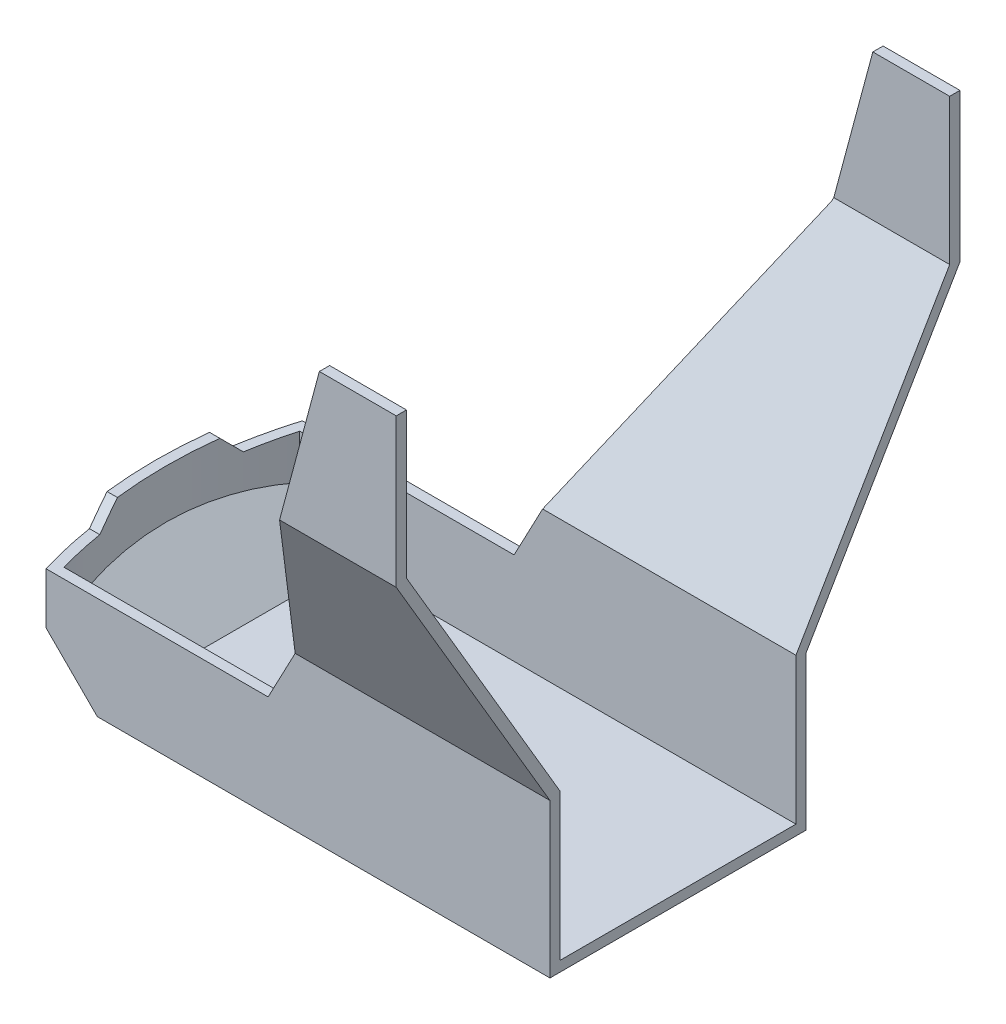
ISO-10303-21;
HEADER;
FILE_DESCRIPTION(('STEP AP214'),'2;1');
FILE_NAME('part.step','',(''),(''),'','','');
FILE_SCHEMA(('AUTOMOTIVE_DESIGN { 1 0 10303 214 1 1 1 1 }'));
ENDSEC;
DATA;
#1=APPLICATION_CONTEXT('core data for automotive mechanical design processes');
#2=APPLICATION_PROTOCOL_DEFINITION('international standard','automotive_design',2000,#1);
#3=PRODUCT_CONTEXT('',#1,'mechanical');
#4=PRODUCT('Part','Part','',(#3));
#5=PRODUCT_RELATED_PRODUCT_CATEGORY('part','',(#4));
#6=PRODUCT_DEFINITION_FORMATION('','',#4);
#7=PRODUCT_DEFINITION_CONTEXT('part definition',#1,'design');
#8=PRODUCT_DEFINITION('design','',#6,#7);
#9=PRODUCT_DEFINITION_SHAPE('','',#8);
#10=(LENGTH_UNIT() NAMED_UNIT(*) SI_UNIT(.MILLI.,.METRE.));
#11=(NAMED_UNIT(*) PLANE_ANGLE_UNIT() SI_UNIT($,.RADIAN.));
#12=(NAMED_UNIT(*) SI_UNIT($,.STERADIAN.) SOLID_ANGLE_UNIT());
#13=UNCERTAINTY_MEASURE_WITH_UNIT(LENGTH_MEASURE(1.E-05),#10,'distance_accuracy_value','');
#14=(GEOMETRIC_REPRESENTATION_CONTEXT(3) GLOBAL_UNCERTAINTY_ASSIGNED_CONTEXT((#13)) GLOBAL_UNIT_ASSIGNED_CONTEXT((#10,
#11,#12)) REPRESENTATION_CONTEXT('',''));
#15=CARTESIAN_POINT('',(0.,0.,0.));
#16=DIRECTION('',(0.,0.,1.));
#17=DIRECTION('',(1.,0.,0.));
#18=AXIS2_PLACEMENT_3D('',#15,#16,#17);
#19=CARTESIAN_POINT('',(57.5102682913546,81.0222252113279,186.475680518593));
#20=DIRECTION('',(0.884209710262989,-0.46709012864397,0.));
#21=DIRECTION('',(0.46709012864397,0.884209710262989,0.));
#22=AXIS2_PLACEMENT_3D('',#19,#20,#21);
#23=PLANE('',#22);
#24=DIRECTION('',(0.46709012864397,0.884209710262989,0.));
#25=VECTOR('',#24,1.);
#26=CARTESIAN_POINT('',(57.5102682913546,81.0222252113279,31.4919417561051));
#27=LINE('',#26,#25);
#28=CARTESIAN_POINT('',(25.27483964443,20.,31.4919417561051));
#29=VERTEX_POINT('',#28);
#30=CARTESIAN_POINT('',(30.8450010449588,30.5444120867597,31.4919417561051));
#31=VERTEX_POINT('',#30);
#32=EDGE_CURVE('E263',#29,#31,#27,.T.);
#33=ORIENTED_EDGE('',*,*,#32,.F.);
#34=DIRECTION('',(0.,0.,-1.));
#35=VECTOR('',#34,1.);
#36=CARTESIAN_POINT('',(25.27483964443,20.,33.4919417561051));
#37=LINE('',#36,#35);
#38=CARTESIAN_POINT('',(25.27483964443,20.,33.491941756105));
#39=VERTEX_POINT('',#38);
#40=EDGE_CURVE('E385',#39,#29,#37,.T.);
#41=ORIENTED_EDGE('',*,*,#40,.F.);
#42=DIRECTION('',(0.46709012864397,0.884209710262989,0.));
#43=VECTOR('',#42,1.);
#44=CARTESIAN_POINT('',(57.5102682913546,81.0222252113279,33.491941756105));
#45=LINE('',#44,#43);
#46=CARTESIAN_POINT('',(30.5574114508971,30.,33.491941756105));
#47=VERTEX_POINT('',#46);
#48=EDGE_CURVE('E420',#39,#47,#45,.T.);
#49=ORIENTED_EDGE('',*,*,#48,.T.);
#50=DIRECTION('',(0.414427715659653,0.784518849610899,0.461280655456431));
#51=VECTOR('',#50,1.);
#52=CARTESIAN_POINT('',(81.0207607346344,125.527994947383,89.6604023936314));
#53=LINE('',#52,#51);
#54=CARTESIAN_POINT('',(57.5102682913546,81.0222252113279,63.491941756105));
#55=VERTEX_POINT('',#54);
#56=EDGE_CURVE('E321',#47,#55,#53,.T.);
#57=ORIENTED_EDGE('',*,*,#56,.T.);
#58=DIRECTION('',(0.,0.,-1.));
#59=VECTOR('',#58,1.);
#60=CARTESIAN_POINT('',(57.5102682913546,81.0222252113279,186.475680518593));
#61=LINE('',#60,#59);
#62=CARTESIAN_POINT('',(57.5102682913546,81.0222252113279,61.1718388492807));
#63=VERTEX_POINT('',#62);
#64=EDGE_CURVE('E349',#55,#63,#61,.T.);
#65=ORIENTED_EDGE('',*,*,#64,.T.);
#66=DIRECTION('',(0.414427715659653,0.784518849610899,0.461280655456431));
#67=VECTOR('',#66,1.);
#68=CARTESIAN_POINT('',(81.4642889799732,126.367601604117,87.8339706192931));
#69=LINE('',#68,#67);
#70=EDGE_CURVE('E251',#31,#63,#69,.T.);
#71=ORIENTED_EDGE('',*,*,#70,.F.);
#72=EDGE_LOOP('',(#33,#41,#49,#57,#65,#71));
#73=FACE_BOUND('',#72,.T.);
#74=ADVANCED_FACE('F36',(#73),#23,.F.);
#75=CARTESIAN_POINT('',(65.27483964443,20.,8.49194175610506));
#76=DIRECTION('',(0.,1.,0.));
#77=DIRECTION('',(0.,0.,1.));
#78=AXIS2_PLACEMENT_3D('',#75,#76,#77);
#79=PLANE('',#78);
#80=CARTESIAN_POINT('',(65.27483964443,20.,8.49194175610506));
#81=DIRECTION('',(0.,1.,0.));
#82=DIRECTION('',(0.,0.,1.));
#83=AXIS2_PLACEMENT_3D('',#80,#81,#82);
#84=CIRCLE('',#83,85.);
#85=CARTESIAN_POINT('',(-18.5642920304627,20.,22.4919417561051));
#86=VERTEX_POINT('',#85);
#87=CARTESIAN_POINT('',(-16.5542505374851,20.,31.4919417561051));
#88=VERTEX_POINT('',#87);
#89=EDGE_CURVE('E11',#86,#88,#84,.T.);
#90=ORIENTED_EDGE('',*,*,#89,.F.);
#91=DIRECTION('',(1.,0.,0.));
#92=VECTOR('',#91,1.);
#93=CARTESIAN_POINT('',(-20.5913353024022,20.,22.4919417561051));
#94=LINE('',#93,#92);
#95=CARTESIAN_POINT('',(-20.5913353024022,20.,22.4919417561051));
#96=VERTEX_POINT('',#95);
#97=EDGE_CURVE('E341',#96,#86,#94,.T.);
#98=ORIENTED_EDGE('',*,*,#97,.F.);
#99=CARTESIAN_POINT('',(65.27483964443,20.,8.49194175610506));
#100=DIRECTION('',(0.,1.,0.));
#101=DIRECTION('',(0.,0.,1.));
#102=AXIS2_PLACEMENT_3D('',#99,#100,#101);
#103=CIRCLE('',#102,87.);
#104=CARTESIAN_POINT('',(-18.0558269795686,20.,33.491941756105));
#105=VERTEX_POINT('',#104);
#106=EDGE_CURVE('E390',#96,#105,#103,.T.);
#107=ORIENTED_EDGE('',*,*,#106,.T.);
#108=DIRECTION('',(1.,0.,0.));
#109=VECTOR('',#108,1.);
#110=CARTESIAN_POINT('',(-18.0558269795686,20.,33.4919417561051));
#111=LINE('',#110,#109);
#112=EDGE_CURVE('E380',#105,#39,#111,.T.);
#113=ORIENTED_EDGE('',*,*,#112,.T.);
#114=ORIENTED_EDGE('',*,*,#40,.T.);
#115=DIRECTION('',(1.,0.,0.));
#116=VECTOR('',#115,1.);
#117=CARTESIAN_POINT('',(-18.0558269795686,20.,31.4919417561051));
#118=LINE('',#117,#116);
#119=EDGE_CURVE('E242',#88,#29,#118,.T.);
#120=ORIENTED_EDGE('',*,*,#119,.F.);
#121=EDGE_LOOP('',(#90,#98,#107,#113,#114,#120));
#122=FACE_BOUND('',#121,.T.);
#123=ADVANCED_FACE('F492',(#122),#79,.T.);
#124=CARTESIAN_POINT('',(65.27483964443,110.,186.475680518593));
#125=DIRECTION('',(0.96592582628907,-0.258819045102514,0.));
#126=DIRECTION('',(0.258819045102514,0.96592582628907,0.));
#127=AXIS2_PLACEMENT_3D('',#124,#125,#126);
#128=PLANE('',#127);
#129=DIRECTION('',(0.225054885754992,0.839916268129265,0.493853177502804));
#130=VECTOR('',#129,1.);
#131=CARTESIAN_POINT('',(77.3079098811486,154.90802949448,104.615144571714));
#132=LINE('',#131,#130);
#133=CARTESIAN_POINT('',(57.6561430703516,81.5666372980876,61.491941756105));
#134=VERTEX_POINT('',#133);
#135=EDGE_CURVE('E301',#63,#134,#132,.T.);
#136=ORIENTED_EDGE('',*,*,#135,.F.);
#137=ORIENTED_EDGE('',*,*,#64,.F.);
#138=DIRECTION('',(0.258819045102514,0.96592582628907,0.));
#139=VECTOR('',#138,1.);
#140=CARTESIAN_POINT('',(65.27483964443,110.,63.491941756105));
#141=LINE('',#140,#139);
#142=CARTESIAN_POINT('',(65.27483964443,110.,63.491941756105));
#143=VERTEX_POINT('',#142);
#144=EDGE_CURVE('E334',#55,#143,#141,.T.);
#145=ORIENTED_EDGE('',*,*,#144,.T.);
#146=DIRECTION('',(0.,0.,-1.));
#147=VECTOR('',#146,1.);
#148=CARTESIAN_POINT('',(65.27483964443,110.,186.475680518593));
#149=LINE('',#148,#147);
#150=CARTESIAN_POINT('',(65.27483964443,110.,61.491941756105));
#151=VERTEX_POINT('',#150);
#152=EDGE_CURVE('E353',#143,#151,#149,.T.);
#153=ORIENTED_EDGE('',*,*,#152,.T.);
#154=DIRECTION('',(0.258819045102514,0.96592582628907,0.));
#155=VECTOR('',#154,1.);
#156=CARTESIAN_POINT('',(65.27483964443,110.,61.491941756105));
#157=LINE('',#156,#155);
#158=EDGE_CURVE('E291',#134,#151,#157,.T.);
#159=ORIENTED_EDGE('',*,*,#158,.F.);
#160=EDGE_LOOP('',(#136,#137,#145,#153,#159));
#161=FACE_BOUND('',#160,.T.);
#162=ADVANCED_FACE('F521',(#161),#128,.F.);
#163=CARTESIAN_POINT('',(65.27483964443,110.,186.475680518593));
#164=DIRECTION('',(0.,-1.,0.));
#165=DIRECTION('',(0.,0.,-1.));
#166=AXIS2_PLACEMENT_3D('',#163,#164,#165);
#167=PLANE('',#166);
#168=DIRECTION('',(1.,0.,0.));
#169=VECTOR('',#168,1.);
#170=CARTESIAN_POINT('',(65.27483964443,110.,61.491941756105));
#171=LINE('',#170,#169);
#172=CARTESIAN_POINT('',(80.27483964443,110.,61.491941756105));
#173=VERTEX_POINT('',#172);
#174=EDGE_CURVE('E235',#151,#173,#171,.T.);
#175=ORIENTED_EDGE('',*,*,#174,.F.);
#176=ORIENTED_EDGE('',*,*,#152,.F.);
#177=DIRECTION('',(1.,0.,0.));
#178=VECTOR('',#177,1.);
#179=CARTESIAN_POINT('',(65.27483964443,110.,63.491941756105));
#180=LINE('',#179,#178);
#181=CARTESIAN_POINT('',(80.27483964443,110.,63.491941756105));
#182=VERTEX_POINT('',#181);
#183=EDGE_CURVE('E337',#143,#182,#180,.T.);
#184=ORIENTED_EDGE('',*,*,#183,.T.);
#185=DIRECTION('',(0.,0.,-1.));
#186=VECTOR('',#185,1.);
#187=CARTESIAN_POINT('',(80.27483964443,110.,186.475680518593));
#188=LINE('',#187,#186);
#189=EDGE_CURVE('E342',#182,#173,#188,.T.);
#190=ORIENTED_EDGE('',*,*,#189,.T.);
#191=EDGE_LOOP('',(#175,#176,#184,#190));
#192=FACE_BOUND('',#191,.T.);
#193=ADVANCED_FACE('F534',(#192),#167,.F.);
#194=CARTESIAN_POINT('',(65.27483964443,0.,8.49194175610506));
#195=DIRECTION('',(0.,1.,0.));
#196=DIRECTION('',(0.,0.,1.));
#197=AXIS2_PLACEMENT_3D('',#194,#195,#196);
#198=PLANE('',#197);
#199=DIRECTION('',(-1.,0.,0.));
#200=VECTOR('',#199,1.);
#201=CARTESIAN_POINT('',(25.27483964443,0.,-16.5080582438949));
#202=LINE('',#201,#200);
#203=CARTESIAN_POINT('',(80.27483964443,0.,-16.508058243895));
#204=VERTEX_POINT('',#203);
#205=CARTESIAN_POINT('',(-8.05582697956865,0.,-16.5080582438949));
#206=VERTEX_POINT('',#205);
#207=EDGE_CURVE('E384',#204,#206,#202,.T.);
#208=ORIENTED_EDGE('',*,*,#207,.F.);
#209=DIRECTION('',(0.,0.,-1.));
#210=VECTOR('',#209,1.);
#211=CARTESIAN_POINT('',(80.27483964443,0.,186.475680518593));
#212=LINE('',#211,#210);
#213=CARTESIAN_POINT('',(80.27483964443,0.,33.491941756105));
#214=VERTEX_POINT('',#213);
#215=EDGE_CURVE('E345',#214,#204,#212,.T.);
#216=ORIENTED_EDGE('',*,*,#215,.F.);
#217=DIRECTION('',(1.,0.,0.));
#218=VECTOR('',#217,1.);
#219=CARTESIAN_POINT('',(-18.0558269795686,0.,33.4919417561051));
#220=LINE('',#219,#218);
#221=CARTESIAN_POINT('',(-8.05582697956864,0.,33.4919417561051));
#222=VERTEX_POINT('',#221);
#223=EDGE_CURVE('E379',#222,#214,#220,.T.);
#224=ORIENTED_EDGE('',*,*,#223,.F.);
#225=DIRECTION('',(0.,0.,1.));
#226=VECTOR('',#225,1.);
#227=CARTESIAN_POINT('',(-8.05582697956864,0.,-16.5080582438949));
#228=LINE('',#227,#226);
#229=EDGE_CURVE('E373',#206,#222,#228,.T.);
#230=ORIENTED_EDGE('',*,*,#229,.F.);
#231=EDGE_LOOP('',(#208,#216,#224,#230));
#232=FACE_BOUND('',#231,.T.);
#233=ADVANCED_FACE('F458',(#232),#198,.F.);
#234=CARTESIAN_POINT('',(80.27483964443,110.,186.475680518593));
#235=DIRECTION('',(-1.,0.,0.));
#236=DIRECTION('',(0.,0.,1.));
#237=AXIS2_PLACEMENT_3D('',#234,#235,#236);
#238=PLANE('',#237);
#239=CARTESIAN_POINT('',(80.27483964443,110.,-44.508058243895));
#240=VERTEX_POINT('',#239);
#241=CARTESIAN_POINT('',(80.27483964443,110.,-46.508058243895));
#242=VERTEX_POINT('',#241);
#243=EDGE_CURVE('E333',#240,#242,#188,.T.);
#244=ORIENTED_EDGE('',*,*,#243,.F.);
#245=DIRECTION('',(0.,-1.,0.));
#246=VECTOR('',#245,1.);
#247=CARTESIAN_POINT('',(80.27483964443,110.,-44.508058243895));
#248=LINE('',#247,#246);
#249=CARTESIAN_POINT('',(80.27483964443,81.5666372980877,-44.508058243895));
#250=VERTEX_POINT('',#249);
#251=EDGE_CURVE('E53',#240,#250,#248,.T.);
#252=ORIENTED_EDGE('',*,*,#251,.T.);
#253=DIRECTION('',(0.,0.862030728946208,-0.50685601737818));
#254=VECTOR('',#253,1.);
#255=CARTESIAN_POINT('',(80.27483964443,82.0359372460843,-44.7839967860025));
#256=LINE('',#255,#254);
#257=CARTESIAN_POINT('',(80.27483964443,30.5444120867597,-14.5080582438949));
#258=VERTEX_POINT('',#257);
#259=EDGE_CURVE('E271',#258,#250,#256,.T.);
#260=ORIENTED_EDGE('',*,*,#259,.F.);
#261=DIRECTION('',(0.,1.,0.));
#262=VECTOR('',#261,1.);
#263=CARTESIAN_POINT('',(80.27483964443,110.,-14.508058243895));
#264=LINE('',#263,#262);
#265=CARTESIAN_POINT('',(80.27483964443,2.,-14.5080582438949));
#266=VERTEX_POINT('',#265);
#267=EDGE_CURVE('E259',#266,#258,#264,.T.);
#268=ORIENTED_EDGE('',*,*,#267,.F.);
#269=DIRECTION('',(0.,0.,-1.));
#270=VECTOR('',#269,1.);
#271=CARTESIAN_POINT('',(80.27483964443,2.,186.475680518593));
#272=LINE('',#271,#270);
#273=CARTESIAN_POINT('',(80.27483964443,2.,31.4919417561051));
#274=VERTEX_POINT('',#273);
#275=EDGE_CURVE('E265',#274,#266,#272,.T.);
#276=ORIENTED_EDGE('',*,*,#275,.F.);
#277=DIRECTION('',(0.,1.,0.));
#278=VECTOR('',#277,1.);
#279=CARTESIAN_POINT('',(80.27483964443,20.,31.4919417561051));
#280=LINE('',#279,#278);
#281=CARTESIAN_POINT('',(80.27483964443,30.5444120867597,31.4919417561051));
#282=VERTEX_POINT('',#281);
#283=EDGE_CURVE('E239',#274,#282,#280,.T.);
#284=ORIENTED_EDGE('',*,*,#283,.T.);
#285=DIRECTION('',(0.,0.862030728946208,0.50685601737818));
#286=VECTOR('',#285,1.);
#287=CARTESIAN_POINT('',(80.27483964443,82.0359372460843,61.7678802982126));
#288=LINE('',#287,#286);
#289=CARTESIAN_POINT('',(80.27483964443,81.5666372980877,61.491941756105));
#290=VERTEX_POINT('',#289);
#291=EDGE_CURVE('E281',#282,#290,#288,.T.);
#292=ORIENTED_EDGE('',*,*,#291,.T.);
#293=DIRECTION('',(0.,-1.,0.));
#294=VECTOR('',#293,1.);
#295=CARTESIAN_POINT('',(80.27483964443,110.,61.491941756105));
#296=LINE('',#295,#294);
#297=EDGE_CURVE('E267',#173,#290,#296,.T.);
#298=ORIENTED_EDGE('',*,*,#297,.F.);
#299=ORIENTED_EDGE('',*,*,#189,.F.);
#300=DIRECTION('',(0.,-1.,0.));
#301=VECTOR('',#300,1.);
#302=CARTESIAN_POINT('',(80.27483964443,110.,63.491941756105));
#303=LINE('',#302,#301);
#304=CARTESIAN_POINT('',(80.27483964443,81.0222252113279,63.491941756105));
#305=VERTEX_POINT('',#304);
#306=EDGE_CURVE('E338',#182,#305,#303,.T.);
#307=ORIENTED_EDGE('',*,*,#306,.T.);
#308=DIRECTION('',(0.,0.862030728946208,0.50685601737818));
#309=VECTOR('',#308,1.);
#310=CARTESIAN_POINT('',(80.27483964443,81.0222252113279,63.491941756105));
#311=LINE('',#310,#309);
#312=CARTESIAN_POINT('',(80.27483964443,30.,33.491941756105));
#313=VERTEX_POINT('',#312);
#314=EDGE_CURVE('E61',#313,#305,#311,.T.);
#315=ORIENTED_EDGE('',*,*,#314,.F.);
#316=DIRECTION('',(0.,1.,0.));
#317=VECTOR('',#316,1.);
#318=CARTESIAN_POINT('',(80.27483964443,0.,33.491941756105));
#319=LINE('',#318,#317);
#320=EDGE_CURVE('E316',#214,#313,#319,.T.);
#321=ORIENTED_EDGE('',*,*,#320,.F.);
#322=ORIENTED_EDGE('',*,*,#215,.T.);
#323=DIRECTION('',(0.,1.,0.));
#324=VECTOR('',#323,1.);
#325=CARTESIAN_POINT('',(80.27483964443,0.,-16.508058243895));
#326=LINE('',#325,#324);
#327=CARTESIAN_POINT('',(80.27483964443,30.,-16.508058243895));
#328=VERTEX_POINT('',#327);
#329=EDGE_CURVE('E307',#204,#328,#326,.T.);
#330=ORIENTED_EDGE('',*,*,#329,.T.);
#331=DIRECTION('',(0.,0.862030728946208,-0.50685601737818));
#332=VECTOR('',#331,1.);
#333=CARTESIAN_POINT('',(80.27483964443,81.0222252113279,-46.508058243895));
#334=LINE('',#333,#332);
#335=CARTESIAN_POINT('',(80.27483964443,81.0222252113279,-46.508058243895));
#336=VERTEX_POINT('',#335);
#337=EDGE_CURVE('E304',#328,#336,#334,.T.);
#338=ORIENTED_EDGE('',*,*,#337,.T.);
#339=DIRECTION('',(0.,-1.,0.));
#340=VECTOR('',#339,1.);
#341=CARTESIAN_POINT('',(80.27483964443,110.,-46.508058243895));
#342=LINE('',#341,#340);
#343=EDGE_CURVE('E324',#242,#336,#342,.T.);
#344=ORIENTED_EDGE('',*,*,#343,.F.);
#345=EDGE_LOOP('',(#244,#252,#260,#268,#276,#284,#292,#298,#299,#307,#315,#321,#322,#330,#338,#344));
#346=FACE_BOUND('',#345,.T.);
#347=ADVANCED_FACE('F452',(#346),#238,.F.);
#348=DIRECTION('',(0.46709012864397,0.884209710262989,0.));
#349=VECTOR('',#348,1.);
#350=CARTESIAN_POINT('',(25.27483964443,20.,-14.5080582438949));
#351=LINE('',#350,#349);
#352=CARTESIAN_POINT('',(25.27483964443,20.,-14.5080582438949));
#353=VERTEX_POINT('',#352);
#354=CARTESIAN_POINT('',(30.8450010449588,30.5444120867597,-14.5080582438949));
#355=VERTEX_POINT('',#354);
#356=EDGE_CURVE('E262',#353,#355,#351,.T.);
#357=ORIENTED_EDGE('',*,*,#356,.T.);
#358=DIRECTION('',(0.414427715659653,0.784518849610899,-0.461280655456431));
#359=VECTOR('',#358,1.);
#360=CARTESIAN_POINT('',(13.414880378346,-2.45110847630071,4.89261690878429));
#361=LINE('',#360,#359);
#362=CARTESIAN_POINT('',(57.5102682913546,81.0222252113279,-44.1879553370706));
#363=VERTEX_POINT('',#362);
#364=EDGE_CURVE('E258',#355,#363,#361,.T.);
#365=ORIENTED_EDGE('',*,*,#364,.T.);
#366=CARTESIAN_POINT('',(57.5102682913546,81.0222252113279,-46.508058243895));
#367=VERTEX_POINT('',#366);
#368=EDGE_CURVE('E348',#363,#367,#61,.T.);
#369=ORIENTED_EDGE('',*,*,#368,.T.);
#370=DIRECTION('',(0.414427715659653,0.784518849610899,-0.461280655456431));
#371=VECTOR('',#370,1.);
#372=CARTESIAN_POINT('',(12.9713521330072,-3.29071513303517,3.06618513444595));
#373=LINE('',#372,#371);
#374=CARTESIAN_POINT('',(30.5574114508971,30.,-16.508058243895));
#375=VERTEX_POINT('',#374);
#376=EDGE_CURVE('E312',#375,#367,#373,.T.);
#377=ORIENTED_EDGE('',*,*,#376,.F.);
#378=DIRECTION('',(0.46709012864397,0.884209710262989,0.));
#379=VECTOR('',#378,1.);
#380=CARTESIAN_POINT('',(57.5102682913546,81.0222252113279,-16.508058243895));
#381=LINE('',#380,#379);
#382=CARTESIAN_POINT('',(25.27483964443,20.,-16.508058243895));
#383=VERTEX_POINT('',#382);
#384=EDGE_CURVE('E40',#383,#375,#381,.T.);
#385=ORIENTED_EDGE('',*,*,#384,.F.);
#386=EDGE_CURVE('E383',#353,#383,#37,.T.);
#387=ORIENTED_EDGE('',*,*,#386,.F.);
#388=EDGE_LOOP('',(#357,#365,#369,#377,#385,#387));
#389=FACE_BOUND('',#388,.T.);
#390=ADVANCED_FACE('F437',(#389),#23,.F.);
#391=CARTESIAN_POINT('',(65.27483964443,110.,-46.508058243895));
#392=DIRECTION('',(0.,0.,1.));
#393=DIRECTION('',(1.,0.,0.));
#394=AXIS2_PLACEMENT_3D('',#391,#392,#393);
#395=PLANE('',#394);
#396=DIRECTION('',(1.,0.,0.));
#397=VECTOR('',#396,1.);
#398=CARTESIAN_POINT('',(65.27483964443,81.0222252113279,-46.508058243895));
#399=LINE('',#398,#397);
#400=EDGE_CURVE('E422',#367,#336,#399,.T.);
#401=ORIENTED_EDGE('',*,*,#400,.F.);
#402=DIRECTION('',(0.258819045102514,0.96592582628907,0.));
#403=VECTOR('',#402,1.);
#404=CARTESIAN_POINT('',(65.27483964443,110.,-46.508058243895));
#405=LINE('',#404,#403);
#406=CARTESIAN_POINT('',(65.27483964443,110.,-46.508058243895));
#407=VERTEX_POINT('',#406);
#408=EDGE_CURVE('E330',#367,#407,#405,.T.);
#409=ORIENTED_EDGE('',*,*,#408,.T.);
#410=DIRECTION('',(1.,0.,0.));
#411=VECTOR('',#410,1.);
#412=CARTESIAN_POINT('',(65.27483964443,110.,-46.508058243895));
#413=LINE('',#412,#411);
#414=EDGE_CURVE('E327',#407,#242,#413,.T.);
#415=ORIENTED_EDGE('',*,*,#414,.T.);
#416=ORIENTED_EDGE('',*,*,#343,.T.);
#417=EDGE_LOOP('',(#401,#409,#415,#416));
#418=FACE_BOUND('',#417,.T.);
#419=ADVANCED_FACE('F446',(#418),#395,.F.);
#420=CARTESIAN_POINT('',(-18.0558269795686,20.,33.4919417561051));
#421=DIRECTION('',(0.,0.,-1.));
#422=DIRECTION('',(-1.,0.,0.));
#423=AXIS2_PLACEMENT_3D('',#420,#421,#422);
#424=PLANE('',#423);
#425=DIRECTION('',(0.,-1.,0.));
#426=VECTOR('',#425,1.);
#427=CARTESIAN_POINT('',(-18.0558269795686,20.,33.491941756105));
#428=LINE('',#427,#426);
#429=CARTESIAN_POINT('',(-18.0558269795686,9.9999999999999,33.4919417561051));
#430=VERTEX_POINT('',#429);
#431=EDGE_CURVE('E394',#105,#430,#428,.T.);
#432=ORIENTED_EDGE('',*,*,#431,.T.);
#433=DIRECTION('',(-0.707106781186551,0.707106781186544,0.));
#434=VECTOR('',#433,1.);
#435=CARTESIAN_POINT('',(-4.02791348978428,-4.02791348978432,33.4919417561051));
#436=LINE('',#435,#434);
#437=EDGE_CURVE('E365',#222,#430,#436,.T.);
#438=ORIENTED_EDGE('',*,*,#437,.F.);
#439=ORIENTED_EDGE('',*,*,#223,.T.);
#440=ORIENTED_EDGE('',*,*,#320,.T.);
#441=DIRECTION('',(1.,0.,0.));
#442=VECTOR('',#441,1.);
#443=CARTESIAN_POINT('',(-21.72516035557,30.,33.491941756105));
#444=LINE('',#443,#442);
#445=EDGE_CURVE('E319',#47,#313,#444,.T.);
#446=ORIENTED_EDGE('',*,*,#445,.F.);
#447=ORIENTED_EDGE('',*,*,#48,.F.);
#448=ORIENTED_EDGE('',*,*,#112,.F.);
#449=EDGE_LOOP('',(#432,#438,#439,#440,#446,#447,#448));
#450=FACE_BOUND('',#449,.T.);
#451=ADVANCED_FACE('F464',(#450),#424,.F.);
#452=CARTESIAN_POINT('',(25.27483964443,20.,-16.5080582438949));
#453=DIRECTION('',(0.,0.,1.));
#454=DIRECTION('',(1.,0.,0.));
#455=AXIS2_PLACEMENT_3D('',#452,#453,#454);
#456=PLANE('',#455);
#457=ORIENTED_EDGE('',*,*,#207,.T.);
#458=DIRECTION('',(-0.707106781186551,0.707106781186544,0.));
#459=VECTOR('',#458,1.);
#460=CARTESIAN_POINT('',(-4.02791348978428,-4.02791348978432,-16.5080582438949));
#461=LINE('',#460,#459);
#462=CARTESIAN_POINT('',(-18.0558269795686,9.9999999999999,-16.5080582438949));
#463=VERTEX_POINT('',#462);
#464=EDGE_CURVE('E370',#206,#463,#461,.T.);
#465=ORIENTED_EDGE('',*,*,#464,.T.);
#466=DIRECTION('',(0.,-1.,0.));
#467=VECTOR('',#466,1.);
#468=CARTESIAN_POINT('',(-18.0558269795686,20.,-16.5080582438949));
#469=LINE('',#468,#467);
#470=CARTESIAN_POINT('',(-18.0558269795686,20.,-16.5080582438949));
#471=VERTEX_POINT('',#470);
#472=EDGE_CURVE('E400',#471,#463,#469,.T.);
#473=ORIENTED_EDGE('',*,*,#472,.F.);
#474=DIRECTION('',(-1.,0.,0.));
#475=VECTOR('',#474,1.);
#476=CARTESIAN_POINT('',(25.27483964443,20.,-16.5080582438949));
#477=LINE('',#476,#475);
#478=EDGE_CURVE('E388',#383,#471,#477,.T.);
#479=ORIENTED_EDGE('',*,*,#478,.F.);
#480=ORIENTED_EDGE('',*,*,#384,.T.);
#481=DIRECTION('',(1.,0.,0.));
#482=VECTOR('',#481,1.);
#483=CARTESIAN_POINT('',(-21.72516035557,30.,-16.508058243895));
#484=LINE('',#483,#482);
#485=EDGE_CURVE('E310',#375,#328,#484,.T.);
#486=ORIENTED_EDGE('',*,*,#485,.T.);
#487=ORIENTED_EDGE('',*,*,#329,.F.);
#488=EDGE_LOOP('',(#457,#465,#473,#479,#480,#486,#487));
#489=FACE_BOUND('',#488,.T.);
#490=ADVANCED_FACE('F430',(#489),#456,.F.);
#491=CARTESIAN_POINT('',(65.27483964443,20.,8.49194175610506));
#492=DIRECTION('',(0.,-1.,0.));
#493=DIRECTION('',(0.,0.,-1.));
#494=AXIS2_PLACEMENT_3D('',#491,#492,#493);
#495=CYLINDRICAL_SURFACE('',#494,87.);
#496=CARTESIAN_POINT('',(65.27483964443,24.,8.49194175610506));
#497=DIRECTION('',(0.,1.,0.));
#498=DIRECTION('',(0.,0.,1.));
#499=AXIS2_PLACEMENT_3D('',#496,#497,#498);
#500=CIRCLE('',#499,87.);
#501=CARTESIAN_POINT('',(-21.1485368228199,24.,-1.50805824389493));
#502=VERTEX_POINT('',#501);
#503=CARTESIAN_POINT('',(-21.1485368228199,24.,18.4919417561051));
#504=VERTEX_POINT('',#503);
#505=EDGE_CURVE('E358',#502,#504,#500,.T.);
#506=ORIENTED_EDGE('',*,*,#505,.F.);
#507=CARTESIAN_POINT('',(65.27483964443,34.,8.49194175610506));
#508=DIRECTION('',(0.,0.707106781186546,-0.707106781186549));
#509=DIRECTION('',(0.,-0.707106781186549,-0.707106781186546));
#510=AXIS2_PLACEMENT_3D('',#507,#508,#509);
#511=ELLIPSE('',#510,123.03657992646,87.);
#512=CARTESIAN_POINT('',(-20.5913353024022,20.,-5.50805824389493));
#513=VERTEX_POINT('',#512);
#514=EDGE_CURVE('E411',#502,#513,#511,.F.);
#515=ORIENTED_EDGE('',*,*,#514,.T.);
#516=EDGE_CURVE('E391',#471,#513,#103,.T.);
#517=ORIENTED_EDGE('',*,*,#516,.F.);
#518=ORIENTED_EDGE('',*,*,#472,.T.);
#519=CARTESIAN_POINT('',(65.27483964443,-73.3306666239979,8.49194175610506));
#520=DIRECTION('',(0.707106781186544,0.707106781186551,0.));
#521=DIRECTION('',(0.707106781186551,-0.707106781186544,0.));
#522=AXIS2_PLACEMENT_3D('',#519,#520,#521);
#523=ELLIPSE('',#522,123.036579926459,87.);
#524=EDGE_CURVE('E376',#463,#430,#523,.T.);
#525=ORIENTED_EDGE('',*,*,#524,.T.);
#526=ORIENTED_EDGE('',*,*,#431,.F.);
#527=ORIENTED_EDGE('',*,*,#106,.F.);
#528=CARTESIAN_POINT('',(65.27483964443,34.0000000000001,8.49194175610506));
#529=DIRECTION('',(0.,0.707106781186546,0.707106781186549));
#530=DIRECTION('',(0.,-0.707106781186549,0.707106781186546));
#531=AXIS2_PLACEMENT_3D('',#528,#529,#530);
#532=ELLIPSE('',#531,123.03657992646,87.);
#533=EDGE_CURVE('E409',#96,#504,#532,.F.);
#534=ORIENTED_EDGE('',*,*,#533,.T.);
#535=EDGE_LOOP('',(#506,#515,#517,#518,#525,#526,#527,#534));
#536=FACE_BOUND('',#535,.T.);
#537=ADVANCED_FACE('F470',(#536),#495,.T.);
#538=CARTESIAN_POINT('',(-16.5542505374851,20.,-14.5080582438949));
#539=VERTEX_POINT('',#538);
#540=CARTESIAN_POINT('',(-18.5642920304627,20.,-5.50805824389493));
#541=VERTEX_POINT('',#540);
#542=EDGE_CURVE('E46',#539,#541,#84,.T.);
#543=ORIENTED_EDGE('',*,*,#542,.F.);
#544=DIRECTION('',(-1.,0.,0.));
#545=VECTOR('',#544,1.);
#546=CARTESIAN_POINT('',(25.27483964443,20.,-14.5080582438949));
#547=LINE('',#546,#545);
#548=EDGE_CURVE('E285',#353,#539,#547,.T.);
#549=ORIENTED_EDGE('',*,*,#548,.F.);
#550=ORIENTED_EDGE('',*,*,#386,.T.);
#551=ORIENTED_EDGE('',*,*,#478,.T.);
#552=ORIENTED_EDGE('',*,*,#516,.T.);
#553=DIRECTION('',(-1.,0.,0.));
#554=VECTOR('',#553,1.);
#555=CARTESIAN_POINT('',(-20.5913353024022,20.,-5.50805824389493));
#556=LINE('',#555,#554);
#557=EDGE_CURVE('E362',#541,#513,#556,.T.);
#558=ORIENTED_EDGE('',*,*,#557,.F.);
#559=EDGE_LOOP('',(#543,#549,#550,#551,#552,#558));
#560=FACE_BOUND('',#559,.T.);
#561=ADVANCED_FACE('F476',(#560),#79,.T.);
#562=CARTESIAN_POINT('',(-4.02791348978428,-4.02791348978432,-16.5080582438949));
#563=DIRECTION('',(0.707106781186544,0.707106781186551,0.));
#564=DIRECTION('',(-0.707106781186551,0.707106781186544,0.));
#565=AXIS2_PLACEMENT_3D('',#562,#563,#564);
#566=PLANE('',#565);
#567=ORIENTED_EDGE('',*,*,#464,.F.);
#568=ORIENTED_EDGE('',*,*,#229,.T.);
#569=ORIENTED_EDGE('',*,*,#437,.T.);
#570=ORIENTED_EDGE('',*,*,#524,.F.);
#571=EDGE_LOOP('',(#567,#568,#569,#570));
#572=FACE_BOUND('',#571,.T.);
#573=ADVANCED_FACE('F462',(#572),#566,.F.);
#574=CARTESIAN_POINT('',(65.27483964443,24.,8.49194175610506));
#575=DIRECTION('',(0.,-1.,0.));
#576=DIRECTION('',(0.,0.,-1.));
#577=AXIS2_PLACEMENT_3D('',#574,#575,#576);
#578=CYLINDRICAL_SURFACE('',#577,85.);
#579=CARTESIAN_POINT('',(65.27483964443,34.0000000000001,8.49194175610506));
#580=DIRECTION('',(0.,0.707106781186546,0.707106781186549));
#581=DIRECTION('',(0.,-0.707106781186549,0.707106781186546));
#582=AXIS2_PLACEMENT_3D('',#579,#580,#581);
#583=ELLIPSE('',#582,120.208152801713,85.);
#584=CARTESIAN_POINT('',(-19.1348754362407,24.,18.4919417561051));
#585=VERTEX_POINT('',#584);
#586=EDGE_CURVE('E413',#585,#86,#583,.T.);
#587=ORIENTED_EDGE('',*,*,#586,.T.);
#588=ORIENTED_EDGE('',*,*,#89,.T.);
#589=DIRECTION('',(0.,-1.,0.));
#590=VECTOR('',#589,1.);
#591=CARTESIAN_POINT('',(-16.5542505374851,20.,31.4919417561051));
#592=LINE('',#591,#590);
#593=CARTESIAN_POINT('',(-16.5542505374851,11.3268506826626,31.4919417561051));
#594=VERTEX_POINT('',#593);
#595=EDGE_CURVE('E246',#88,#594,#592,.T.);
#596=ORIENTED_EDGE('',*,*,#595,.T.);
#597=CARTESIAN_POINT('',(65.27483964443,-70.5022394992517,8.49194175610506));
#598=DIRECTION('',(0.707106781186544,0.707106781186551,0.));
#599=DIRECTION('',(0.707106781186551,-0.707106781186544,0.));
#600=AXIS2_PLACEMENT_3D('',#597,#598,#599);
#601=ELLIPSE('',#600,120.208152801712,85.);
#602=CARTESIAN_POINT('',(-16.5542505374851,11.3268506826626,-14.5080582438949));
#603=VERTEX_POINT('',#602);
#604=EDGE_CURVE('E226',#603,#594,#601,.T.);
#605=ORIENTED_EDGE('',*,*,#604,.F.);
#606=DIRECTION('',(0.,-1.,0.));
#607=VECTOR('',#606,1.);
#608=CARTESIAN_POINT('',(-16.5542505374851,20.,-14.5080582438949));
#609=LINE('',#608,#607);
#610=EDGE_CURVE('E247',#539,#603,#609,.T.);
#611=ORIENTED_EDGE('',*,*,#610,.F.);
#612=ORIENTED_EDGE('',*,*,#542,.T.);
#613=CARTESIAN_POINT('',(65.27483964443,34.,8.49194175610506));
#614=DIRECTION('',(0.,0.707106781186546,-0.707106781186549));
#615=DIRECTION('',(0.,-0.707106781186549,-0.707106781186546));
#616=AXIS2_PLACEMENT_3D('',#613,#614,#615);
#617=ELLIPSE('',#616,120.208152801713,85.);
#618=CARTESIAN_POINT('',(-19.1348754362407,24.,-1.50805824389493));
#619=VERTEX_POINT('',#618);
#620=EDGE_CURVE('E416',#541,#619,#617,.T.);
#621=ORIENTED_EDGE('',*,*,#620,.T.);
#622=CARTESIAN_POINT('',(65.27483964443,24.,8.49194175610506));
#623=DIRECTION('',(0.,-1.,0.));
#624=DIRECTION('',(0.,0.,1.));
#625=AXIS2_PLACEMENT_3D('',#622,#623,#624);
#626=CIRCLE('',#625,85.);
#627=EDGE_CURVE('E361',#585,#619,#626,.T.);
#628=ORIENTED_EDGE('',*,*,#627,.F.);
#629=EDGE_LOOP('',(#587,#588,#596,#605,#611,#612,#621,#628));
#630=FACE_BOUND('',#629,.T.);
#631=ADVANCED_FACE('F483',(#630),#578,.F.);
#632=CARTESIAN_POINT('',(65.27483964443,24.,8.49194175610506));
#633=DIRECTION('',(0.,1.,0.));
#634=DIRECTION('',(0.,0.,1.));
#635=AXIS2_PLACEMENT_3D('',#632,#633,#634);
#636=PLANE('',#635);
#637=ORIENTED_EDGE('',*,*,#627,.T.);
#638=DIRECTION('',(-1.,0.,0.));
#639=VECTOR('',#638,1.);
#640=CARTESIAN_POINT('',(-20.5913353024022,24.,-1.50805824389493));
#641=LINE('',#640,#639);
#642=EDGE_CURVE('E406',#619,#502,#641,.T.);
#643=ORIENTED_EDGE('',*,*,#642,.T.);
#644=ORIENTED_EDGE('',*,*,#505,.T.);
#645=DIRECTION('',(1.,0.,0.));
#646=VECTOR('',#645,1.);
#647=CARTESIAN_POINT('',(-18.5642920304627,24.,18.4919417561051));
#648=LINE('',#647,#646);
#649=EDGE_CURVE('E403',#504,#585,#648,.T.);
#650=ORIENTED_EDGE('',*,*,#649,.T.);
#651=EDGE_LOOP('',(#637,#643,#644,#650));
#652=FACE_BOUND('',#651,.T.);
#653=ADVANCED_FACE('F486',(#652),#636,.T.);
#654=CARTESIAN_POINT('',(65.27483964443,24.,-1.50805824389493));
#655=DIRECTION('',(0.,0.707106781186546,-0.707106781186549));
#656=DIRECTION('',(1.,0.,0.));
#657=AXIS2_PLACEMENT_3D('',#654,#655,#656);
#658=PLANE('',#657);
#659=ORIENTED_EDGE('',*,*,#620,.F.);
#660=ORIENTED_EDGE('',*,*,#557,.T.);
#661=ORIENTED_EDGE('',*,*,#514,.F.);
#662=ORIENTED_EDGE('',*,*,#642,.F.);
#663=EDGE_LOOP('',(#659,#660,#661,#662));
#664=FACE_BOUND('',#663,.T.);
#665=ADVANCED_FACE('F479',(#664),#658,.T.);
#666=CARTESIAN_POINT('',(65.27483964443,24.,18.4919417561051));
#667=DIRECTION('',(0.,0.707106781186546,0.707106781186549));
#668=DIRECTION('',(-1.,0.,0.));
#669=AXIS2_PLACEMENT_3D('',#666,#667,#668);
#670=PLANE('',#669);
#671=ORIENTED_EDGE('',*,*,#533,.F.);
#672=ORIENTED_EDGE('',*,*,#97,.T.);
#673=ORIENTED_EDGE('',*,*,#586,.F.);
#674=ORIENTED_EDGE('',*,*,#649,.F.);
#675=EDGE_LOOP('',(#671,#672,#673,#674));
#676=FACE_BOUND('',#675,.T.);
#677=ADVANCED_FACE('F38',(#676),#670,.T.);
#678=DIRECTION('',(0.225054885754992,0.839916268129265,-0.493853177502804));
#679=VECTOR('',#678,1.);
#680=CARTESIAN_POINT('',(37.744235483826,7.25438650955572,-0.814010906245805));
#681=LINE('',#680,#679);
#682=CARTESIAN_POINT('',(57.6561430703516,81.5666372980877,-44.508058243895));
#683=VERTEX_POINT('',#682);
#684=EDGE_CURVE('E284',#363,#683,#681,.T.);
#685=ORIENTED_EDGE('',*,*,#684,.T.);
#686=DIRECTION('',(0.258819045102514,0.96592582628907,0.));
#687=VECTOR('',#686,1.);
#688=CARTESIAN_POINT('',(65.27483964443,110.,-44.508058243895));
#689=LINE('',#688,#687);
#690=CARTESIAN_POINT('',(65.27483964443,110.,-44.508058243895));
#691=VERTEX_POINT('',#690);
#692=EDGE_CURVE('E268',#683,#691,#689,.T.);
#693=ORIENTED_EDGE('',*,*,#692,.T.);
#694=EDGE_CURVE('E352',#691,#407,#149,.T.);
#695=ORIENTED_EDGE('',*,*,#694,.T.);
#696=ORIENTED_EDGE('',*,*,#408,.F.);
#697=ORIENTED_EDGE('',*,*,#368,.F.);
#698=EDGE_LOOP('',(#685,#693,#695,#696,#697));
#699=FACE_BOUND('',#698,.T.);
#700=ADVANCED_FACE('F442',(#699),#128,.F.);
#701=ORIENTED_EDGE('',*,*,#694,.F.);
#702=DIRECTION('',(1.,0.,0.));
#703=VECTOR('',#702,1.);
#704=CARTESIAN_POINT('',(65.27483964443,110.,-44.508058243895));
#705=LINE('',#704,#703);
#706=EDGE_CURVE('E275',#691,#240,#705,.T.);
#707=ORIENTED_EDGE('',*,*,#706,.T.);
#708=ORIENTED_EDGE('',*,*,#243,.T.);
#709=ORIENTED_EDGE('',*,*,#414,.F.);
#710=EDGE_LOOP('',(#701,#707,#708,#709));
#711=FACE_BOUND('',#710,.T.);
#712=ADVANCED_FACE('F449',(#711),#167,.F.);
#713=CARTESIAN_POINT('',(65.27483964443,110.,63.491941756105));
#714=DIRECTION('',(0.,0.,-1.));
#715=DIRECTION('',(-1.,0.,0.));
#716=AXIS2_PLACEMENT_3D('',#713,#714,#715);
#717=PLANE('',#716);
#718=ORIENTED_EDGE('',*,*,#144,.F.);
#719=DIRECTION('',(1.,0.,0.));
#720=VECTOR('',#719,1.);
#721=CARTESIAN_POINT('',(65.27483964443,81.0222252113279,63.491941756105));
#722=LINE('',#721,#720);
#723=EDGE_CURVE('E418',#55,#305,#722,.T.);
#724=ORIENTED_EDGE('',*,*,#723,.T.);
#725=ORIENTED_EDGE('',*,*,#306,.F.);
#726=ORIENTED_EDGE('',*,*,#183,.F.);
#727=EDGE_LOOP('',(#718,#724,#725,#726));
#728=FACE_BOUND('',#727,.T.);
#729=ADVANCED_FACE('F537',(#728),#717,.F.);
#730=CARTESIAN_POINT('',(-21.72516035557,81.0222252113279,63.491941756105));
#731=DIRECTION('',(0.,0.50685601737818,-0.862030728946208));
#732=DIRECTION('',(0.,0.862030728946208,0.50685601737818));
#733=AXIS2_PLACEMENT_3D('',#730,#731,#732);
#734=PLANE('',#733);
#735=ORIENTED_EDGE('',*,*,#445,.T.);
#736=ORIENTED_EDGE('',*,*,#314,.T.);
#737=ORIENTED_EDGE('',*,*,#723,.F.);
#738=ORIENTED_EDGE('',*,*,#56,.F.);
#739=EDGE_LOOP('',(#735,#736,#737,#738));
#740=FACE_BOUND('',#739,.T.);
#741=ADVANCED_FACE('F539',(#740),#734,.F.);
#742=CARTESIAN_POINT('',(-21.72516035557,81.0222252113279,-46.508058243895));
#743=DIRECTION('',(0.,-0.50685601737818,-0.862030728946208));
#744=DIRECTION('',(0.,0.862030728946208,-0.50685601737818));
#745=AXIS2_PLACEMENT_3D('',#742,#743,#744);
#746=PLANE('',#745);
#747=ORIENTED_EDGE('',*,*,#376,.T.);
#748=ORIENTED_EDGE('',*,*,#400,.T.);
#749=ORIENTED_EDGE('',*,*,#337,.F.);
#750=ORIENTED_EDGE('',*,*,#485,.F.);
#751=EDGE_LOOP('',(#747,#748,#749,#750));
#752=FACE_BOUND('',#751,.T.);
#753=ADVANCED_FACE('F436',(#752),#746,.T.);
#754=CARTESIAN_POINT('',(65.27483964443,2.,8.49194175610506));
#755=DIRECTION('',(0.,1.,0.));
#756=DIRECTION('',(0.,0.,1.));
#757=AXIS2_PLACEMENT_3D('',#754,#755,#756);
#758=PLANE('',#757);
#759=DIRECTION('',(-1.,0.,0.));
#760=VECTOR('',#759,1.);
#761=CARTESIAN_POINT('',(25.27483964443,2.,-14.5080582438949));
#762=LINE('',#761,#760);
#763=CARTESIAN_POINT('',(-7.22739985482246,2.,-14.5080582438949));
#764=VERTEX_POINT('',#763);
#765=EDGE_CURVE('E223',#266,#764,#762,.T.);
#766=ORIENTED_EDGE('',*,*,#765,.T.);
#767=DIRECTION('',(0.,0.,1.));
#768=VECTOR('',#767,1.);
#769=CARTESIAN_POINT('',(-7.22739985482246,2.,-16.5080582438949));
#770=LINE('',#769,#768);
#771=CARTESIAN_POINT('',(-7.22739985482246,2.,31.4919417561051));
#772=VERTEX_POINT('',#771);
#773=EDGE_CURVE('E216',#764,#772,#770,.T.);
#774=ORIENTED_EDGE('',*,*,#773,.T.);
#775=DIRECTION('',(1.,0.,0.));
#776=VECTOR('',#775,1.);
#777=CARTESIAN_POINT('',(-18.0558269795686,2.,31.4919417561051));
#778=LINE('',#777,#776);
#779=EDGE_CURVE('E221',#772,#274,#778,.T.);
#780=ORIENTED_EDGE('',*,*,#779,.T.);
#781=ORIENTED_EDGE('',*,*,#275,.T.);
#782=EDGE_LOOP('',(#766,#774,#780,#781));
#783=FACE_BOUND('',#782,.T.);
#784=ADVANCED_FACE('F218',(#783),#758,.T.);
#785=CARTESIAN_POINT('',(65.27483964443,110.,-44.508058243895));
#786=DIRECTION('',(0.,0.,1.));
#787=DIRECTION('',(1.,0.,0.));
#788=AXIS2_PLACEMENT_3D('',#785,#786,#787);
#789=PLANE('',#788);
#790=DIRECTION('',(1.,0.,0.));
#791=VECTOR('',#790,1.);
#792=CARTESIAN_POINT('',(65.27483964443,81.5666372980876,-44.508058243895));
#793=LINE('',#792,#791);
#794=EDGE_CURVE('E260',#683,#250,#793,.T.);
#795=ORIENTED_EDGE('',*,*,#794,.T.);
#796=ORIENTED_EDGE('',*,*,#251,.F.);
#797=ORIENTED_EDGE('',*,*,#706,.F.);
#798=ORIENTED_EDGE('',*,*,#692,.F.);
#799=EDGE_LOOP('',(#795,#796,#797,#798));
#800=FACE_BOUND('',#799,.T.);
#801=ADVANCED_FACE('F507',(#800),#789,.T.);
#802=CARTESIAN_POINT('',(-18.0558269795686,20.,31.4919417561051));
#803=DIRECTION('',(0.,0.,-1.));
#804=DIRECTION('',(-1.,0.,0.));
#805=AXIS2_PLACEMENT_3D('',#802,#803,#804);
#806=PLANE('',#805);
#807=ORIENTED_EDGE('',*,*,#595,.F.);
#808=ORIENTED_EDGE('',*,*,#119,.T.);
#809=ORIENTED_EDGE('',*,*,#32,.T.);
#810=DIRECTION('',(1.,0.,0.));
#811=VECTOR('',#810,1.);
#812=CARTESIAN_POINT('',(-18.0558269795686,30.5444120867597,31.4919417561051));
#813=LINE('',#812,#811);
#814=EDGE_CURVE('E249',#31,#282,#813,.T.);
#815=ORIENTED_EDGE('',*,*,#814,.T.);
#816=ORIENTED_EDGE('',*,*,#283,.F.);
#817=ORIENTED_EDGE('',*,*,#779,.F.);
#818=DIRECTION('',(-0.707106781186551,0.707106781186544,0.));
#819=VECTOR('',#818,1.);
#820=CARTESIAN_POINT('',(-2.61369992741119,-2.61369992741122,31.4919417561051));
#821=LINE('',#820,#819);
#822=EDGE_CURVE('E230',#772,#594,#821,.T.);
#823=ORIENTED_EDGE('',*,*,#822,.T.);
#824=EDGE_LOOP('',(#807,#808,#809,#815,#816,#817,#823));
#825=FACE_BOUND('',#824,.T.);
#826=ADVANCED_FACE('F237',(#825),#806,.T.);
#827=CARTESIAN_POINT('',(25.27483964443,20.,-14.5080582438949));
#828=DIRECTION('',(0.,0.,1.));
#829=DIRECTION('',(1.,0.,0.));
#830=AXIS2_PLACEMENT_3D('',#827,#828,#829);
#831=PLANE('',#830);
#832=ORIENTED_EDGE('',*,*,#765,.F.);
#833=ORIENTED_EDGE('',*,*,#267,.T.);
#834=DIRECTION('',(1.,0.,0.));
#835=VECTOR('',#834,1.);
#836=CARTESIAN_POINT('',(25.27483964443,30.5444120867597,-14.5080582438949));
#837=LINE('',#836,#835);
#838=EDGE_CURVE('E256',#355,#258,#837,.T.);
#839=ORIENTED_EDGE('',*,*,#838,.F.);
#840=ORIENTED_EDGE('',*,*,#356,.F.);
#841=ORIENTED_EDGE('',*,*,#548,.T.);
#842=ORIENTED_EDGE('',*,*,#610,.T.);
#843=DIRECTION('',(-0.707106781186551,0.707106781186544,0.));
#844=VECTOR('',#843,1.);
#845=CARTESIAN_POINT('',(0.0237198948039551,-5.25111974962634,-14.5080582438949));
#846=LINE('',#845,#844);
#847=EDGE_CURVE('E227',#764,#603,#846,.T.);
#848=ORIENTED_EDGE('',*,*,#847,.F.);
#849=EDGE_LOOP('',(#832,#833,#839,#840,#841,#842,#848));
#850=FACE_BOUND('',#849,.T.);
#851=ADVANCED_FACE('F502',(#850),#831,.T.);
#852=CARTESIAN_POINT('',(-2.61369992741119,-2.61369992741122,-16.5080582438949));
#853=DIRECTION('',(0.707106781186544,0.707106781186551,0.));
#854=DIRECTION('',(-0.707106781186551,0.707106781186544,0.));
#855=AXIS2_PLACEMENT_3D('',#852,#853,#854);
#856=PLANE('',#855);
#857=ORIENTED_EDGE('',*,*,#847,.T.);
#858=ORIENTED_EDGE('',*,*,#604,.T.);
#859=ORIENTED_EDGE('',*,*,#822,.F.);
#860=ORIENTED_EDGE('',*,*,#773,.F.);
#861=EDGE_LOOP('',(#857,#858,#859,#860));
#862=FACE_BOUND('',#861,.T.);
#863=ADVANCED_FACE('F231',(#862),#856,.T.);
#864=CARTESIAN_POINT('',(65.27483964443,110.,61.491941756105));
#865=DIRECTION('',(0.,0.,-1.));
#866=DIRECTION('',(-1.,0.,0.));
#867=AXIS2_PLACEMENT_3D('',#864,#865,#866);
#868=PLANE('',#867);
#869=ORIENTED_EDGE('',*,*,#158,.T.);
#870=ORIENTED_EDGE('',*,*,#174,.T.);
#871=ORIENTED_EDGE('',*,*,#297,.T.);
#872=DIRECTION('',(1.,0.,0.));
#873=VECTOR('',#872,1.);
#874=CARTESIAN_POINT('',(65.27483964443,81.5666372980876,61.491941756105));
#875=LINE('',#874,#873);
#876=EDGE_CURVE('E253',#134,#290,#875,.T.);
#877=ORIENTED_EDGE('',*,*,#876,.F.);
#878=EDGE_LOOP('',(#869,#870,#871,#877));
#879=FACE_BOUND('',#878,.T.);
#880=ADVANCED_FACE('F550',(#879),#868,.T.);
#881=CARTESIAN_POINT('',(-21.72516035557,82.0359372460843,61.7678802982126));
#882=DIRECTION('',(0.,0.50685601737818,-0.862030728946208));
#883=DIRECTION('',(0.,0.862030728946208,0.50685601737818));
#884=AXIS2_PLACEMENT_3D('',#881,#882,#883);
#885=PLANE('',#884);
#886=ORIENTED_EDGE('',*,*,#814,.F.);
#887=ORIENTED_EDGE('',*,*,#70,.T.);
#888=ORIENTED_EDGE('',*,*,#135,.T.);
#889=ORIENTED_EDGE('',*,*,#876,.T.);
#890=ORIENTED_EDGE('',*,*,#291,.F.);
#891=EDGE_LOOP('',(#886,#887,#888,#889,#890));
#892=FACE_BOUND('',#891,.T.);
#893=ADVANCED_FACE('F498',(#892),#885,.T.);
#894=CARTESIAN_POINT('',(-21.72516035557,82.0359372460843,-44.7839967860025));
#895=DIRECTION('',(0.,-0.50685601737818,-0.862030728946208));
#896=DIRECTION('',(0.,0.862030728946208,-0.50685601737818));
#897=AXIS2_PLACEMENT_3D('',#894,#895,#896);
#898=PLANE('',#897);
#899=ORIENTED_EDGE('',*,*,#364,.F.);
#900=ORIENTED_EDGE('',*,*,#838,.T.);
#901=ORIENTED_EDGE('',*,*,#259,.T.);
#902=ORIENTED_EDGE('',*,*,#794,.F.);
#903=ORIENTED_EDGE('',*,*,#684,.F.);
#904=EDGE_LOOP('',(#899,#900,#901,#902,#903));
#905=FACE_BOUND('',#904,.T.);
#906=ADVANCED_FACE('F505',(#905),#898,.F.);
#907=CLOSED_SHELL('',(#74,#123,#162,#193,#233,#347,#390,#419,#451,#490,#537,#561,#573,#631,#653,
#665,#677,#700,#712,#729,#741,#753,#784,#801,#826,#851,#863,#880,#893,#906));
#908=MANIFOLD_SOLID_BREP('B2',#907);
#909=ADVANCED_BREP_SHAPE_REPRESENTATION('',(#18,#908),#14);
#910=SHAPE_DEFINITION_REPRESENTATION(#9,#909);
ENDSEC;
END-ISO-10303-21;
